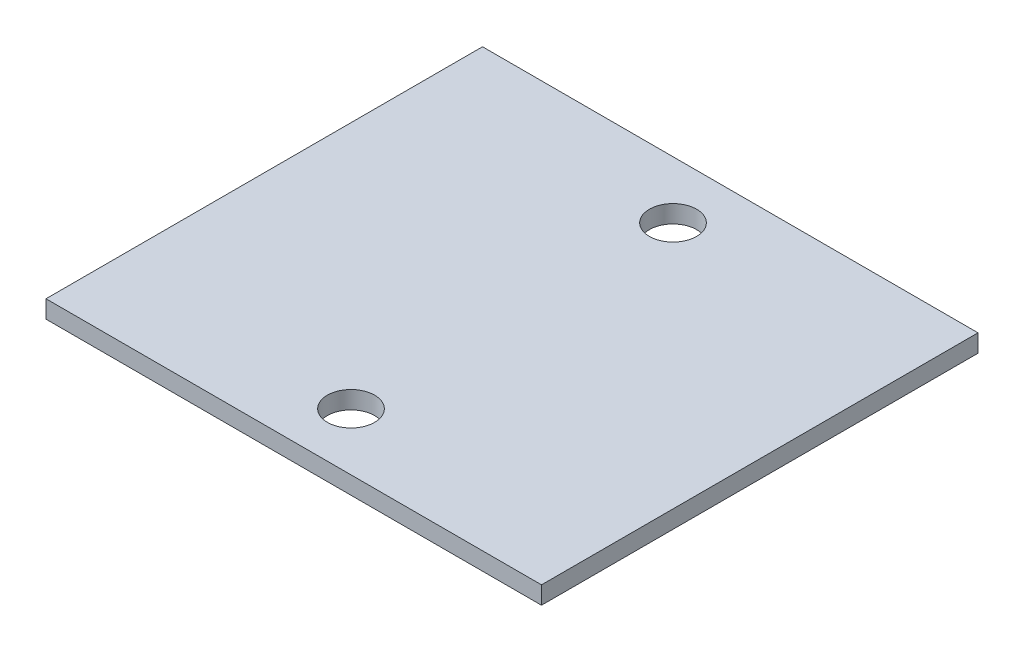
ISO-10303-21;
HEADER;
FILE_DESCRIPTION(('STEP AP214'),'2;1');
FILE_NAME('part.step','',(''),(''),'','','');
FILE_SCHEMA(('AUTOMOTIVE_DESIGN { 1 0 10303 214 1 1 1 1 }'));
ENDSEC;
DATA;
#1=APPLICATION_CONTEXT('core data for automotive mechanical design processes');
#2=APPLICATION_PROTOCOL_DEFINITION('international standard','automotive_design',2000,#1);
#3=PRODUCT_CONTEXT('',#1,'mechanical');
#4=PRODUCT('Part','Part','',(#3));
#5=PRODUCT_RELATED_PRODUCT_CATEGORY('part','',(#4));
#6=PRODUCT_DEFINITION_FORMATION('','',#4);
#7=PRODUCT_DEFINITION_CONTEXT('part definition',#1,'design');
#8=PRODUCT_DEFINITION('design','',#6,#7);
#9=PRODUCT_DEFINITION_SHAPE('','',#8);
#10=(LENGTH_UNIT() NAMED_UNIT(*) SI_UNIT(.MILLI.,.METRE.));
#11=(NAMED_UNIT(*) PLANE_ANGLE_UNIT() SI_UNIT($,.RADIAN.));
#12=(NAMED_UNIT(*) SI_UNIT($,.STERADIAN.) SOLID_ANGLE_UNIT());
#13=UNCERTAINTY_MEASURE_WITH_UNIT(LENGTH_MEASURE(1.E-05),#10,'distance_accuracy_value','');
#14=(GEOMETRIC_REPRESENTATION_CONTEXT(3) GLOBAL_UNCERTAINTY_ASSIGNED_CONTEXT((#13)) GLOBAL_UNIT_ASSIGNED_CONTEXT((#10,
#11,#12)) REPRESENTATION_CONTEXT('',''));
#15=CARTESIAN_POINT('',(0.,0.,0.));
#16=DIRECTION('',(0.,0.,1.));
#17=DIRECTION('',(1.,0.,0.));
#18=AXIS2_PLACEMENT_3D('',#15,#16,#17);
#19=CARTESIAN_POINT('',(0.,1.5,0.));
#20=DIRECTION('',(0.,-1.,0.));
#21=DIRECTION('',(0.,0.,-1.));
#22=AXIS2_PLACEMENT_3D('',#19,#20,#21);
#23=PLANE('',#22);
#24=DIRECTION('',(0.,0.,1.));
#25=VECTOR('',#24,1.);
#26=CARTESIAN_POINT('',(0.,1.5,0.));
#27=LINE('',#26,#25);
#28=CARTESIAN_POINT('',(0.,1.5,-37.));
#29=VERTEX_POINT('',#28);
#30=CARTESIAN_POINT('',(0.,1.5,0.));
#31=VERTEX_POINT('',#30);
#32=EDGE_CURVE('E92',#29,#31,#27,.T.);
#33=ORIENTED_EDGE('',*,*,#32,.T.);
#34=DIRECTION('',(1.,0.,0.));
#35=VECTOR('',#34,1.);
#36=CARTESIAN_POINT('',(0.,1.5,0.));
#37=LINE('',#36,#35);
#38=CARTESIAN_POINT('',(42.,1.5,0.));
#39=VERTEX_POINT('',#38);
#40=EDGE_CURVE('E87',#31,#39,#37,.T.);
#41=ORIENTED_EDGE('',*,*,#40,.T.);
#42=DIRECTION('',(0.,0.,-1.));
#43=VECTOR('',#42,1.);
#44=CARTESIAN_POINT('',(42.,1.5,0.));
#45=LINE('',#44,#43);
#46=CARTESIAN_POINT('',(42.,1.5,-37.));
#47=VERTEX_POINT('',#46);
#48=EDGE_CURVE('E90',#39,#47,#45,.T.);
#49=ORIENTED_EDGE('',*,*,#48,.T.);
#50=DIRECTION('',(-1.,0.,0.));
#51=VECTOR('',#50,1.);
#52=CARTESIAN_POINT('',(0.,1.5,-37.));
#53=LINE('',#52,#51);
#54=EDGE_CURVE('E57',#47,#29,#53,.T.);
#55=ORIENTED_EDGE('',*,*,#54,.T.);
#56=EDGE_LOOP('',(#33,#41,#49,#55));
#57=FACE_BOUND('',#56,.T.);
#58=CARTESIAN_POINT('',(21.,1.5,-32.1488469447029));
#59=DIRECTION('',(0.,1.,0.));
#60=DIRECTION('',(0.,0.,1.));
#61=AXIS2_PLACEMENT_3D('',#58,#59,#60);
#62=CIRCLE('',#61,2.00000000000001);
#63=CARTESIAN_POINT('',(21.,1.5,-30.1488469447029));
#64=VERTEX_POINT('',#63);
#65=EDGE_CURVE('E112',#64,#64,#62,.T.);
#66=ORIENTED_EDGE('',*,*,#65,.F.);
#67=EDGE_LOOP('',(#66));
#68=FACE_BOUND('',#67,.T.);
#69=CARTESIAN_POINT('',(21.,1.5,-4.85115305529707));
#70=DIRECTION('',(0.,1.,0.));
#71=DIRECTION('',(0.,0.,-1.));
#72=AXIS2_PLACEMENT_3D('',#69,#70,#71);
#73=CIRCLE('',#72,2.);
#74=CARTESIAN_POINT('',(21.,1.5,-6.85115305529707));
#75=VERTEX_POINT('',#74);
#76=EDGE_CURVE('E134',#75,#75,#73,.T.);
#77=ORIENTED_EDGE('',*,*,#76,.F.);
#78=EDGE_LOOP('',(#77));
#79=FACE_BOUND('',#78,.T.);
#80=ADVANCED_FACE('F39',(#57,#68,#79),#23,.F.);
#81=CARTESIAN_POINT('',(0.,0.,0.));
#82=DIRECTION('',(0.,-1.,0.));
#83=DIRECTION('',(0.,0.,-1.));
#84=AXIS2_PLACEMENT_3D('',#81,#82,#83);
#85=PLANE('',#84);
#86=CARTESIAN_POINT('',(21.,0.,-32.1488469447029));
#87=DIRECTION('',(0.,1.,0.));
#88=DIRECTION('',(0.,0.,1.));
#89=AXIS2_PLACEMENT_3D('',#86,#87,#88);
#90=CIRCLE('',#89,2.00000000000001);
#91=CARTESIAN_POINT('',(21.,0.,-30.1488469447029));
#92=VERTEX_POINT('',#91);
#93=EDGE_CURVE('E130',#92,#92,#90,.T.);
#94=ORIENTED_EDGE('',*,*,#93,.T.);
#95=EDGE_LOOP('',(#94));
#96=FACE_BOUND('',#95,.T.);
#97=DIRECTION('',(0.,0.,1.));
#98=VECTOR('',#97,1.);
#99=CARTESIAN_POINT('',(0.,0.,0.));
#100=LINE('',#99,#98);
#101=CARTESIAN_POINT('',(0.,0.,-37.));
#102=VERTEX_POINT('',#101);
#103=CARTESIAN_POINT('',(0.,0.,0.));
#104=VERTEX_POINT('',#103);
#105=EDGE_CURVE('E108',#102,#104,#100,.T.);
#106=ORIENTED_EDGE('',*,*,#105,.F.);
#107=DIRECTION('',(-1.,0.,0.));
#108=VECTOR('',#107,1.);
#109=CARTESIAN_POINT('',(0.,0.,-37.));
#110=LINE('',#109,#108);
#111=CARTESIAN_POINT('',(42.,0.,-37.));
#112=VERTEX_POINT('',#111);
#113=EDGE_CURVE('E80',#112,#102,#110,.T.);
#114=ORIENTED_EDGE('',*,*,#113,.F.);
#115=DIRECTION('',(0.,0.,-1.));
#116=VECTOR('',#115,1.);
#117=CARTESIAN_POINT('',(42.,0.,0.));
#118=LINE('',#117,#116);
#119=CARTESIAN_POINT('',(42.,0.,0.));
#120=VERTEX_POINT('',#119);
#121=EDGE_CURVE('E74',#120,#112,#118,.T.);
#122=ORIENTED_EDGE('',*,*,#121,.F.);
#123=DIRECTION('',(1.,0.,0.));
#124=VECTOR('',#123,1.);
#125=CARTESIAN_POINT('',(0.,0.,0.));
#126=LINE('',#125,#124);
#127=EDGE_CURVE('E97',#104,#120,#126,.T.);
#128=ORIENTED_EDGE('',*,*,#127,.F.);
#129=EDGE_LOOP('',(#106,#114,#122,#128));
#130=FACE_BOUND('',#129,.T.);
#131=CARTESIAN_POINT('',(21.,0.,-4.85115305529707));
#132=DIRECTION('',(0.,1.,0.));
#133=DIRECTION('',(0.,0.,-1.));
#134=AXIS2_PLACEMENT_3D('',#131,#132,#133);
#135=CIRCLE('',#134,2.);
#136=CARTESIAN_POINT('',(21.,0.,-6.85115305529707));
#137=VERTEX_POINT('',#136);
#138=EDGE_CURVE('E138',#137,#137,#135,.T.);
#139=ORIENTED_EDGE('',*,*,#138,.T.);
#140=EDGE_LOOP('',(#139));
#141=FACE_BOUND('',#140,.T.);
#142=ADVANCED_FACE('F125',(#96,#130,#141),#85,.T.);
#143=CARTESIAN_POINT('',(0.,1.5,0.));
#144=DIRECTION('',(1.,0.,0.));
#145=DIRECTION('',(0.,0.,-1.));
#146=AXIS2_PLACEMENT_3D('',#143,#144,#145);
#147=PLANE('',#146);
#148=ORIENTED_EDGE('',*,*,#105,.T.);
#149=DIRECTION('',(0.,-1.,0.));
#150=VECTOR('',#149,1.);
#151=CARTESIAN_POINT('',(0.,1.5,0.));
#152=LINE('',#151,#150);
#153=EDGE_CURVE('E11',#31,#104,#152,.T.);
#154=ORIENTED_EDGE('',*,*,#153,.F.);
#155=ORIENTED_EDGE('',*,*,#32,.F.);
#156=DIRECTION('',(0.,-1.,0.));
#157=VECTOR('',#156,1.);
#158=CARTESIAN_POINT('',(0.,1.5,-37.));
#159=LINE('',#158,#157);
#160=EDGE_CURVE('E104',#29,#102,#159,.T.);
#161=ORIENTED_EDGE('',*,*,#160,.T.);
#162=EDGE_LOOP('',(#148,#154,#155,#161));
#163=FACE_BOUND('',#162,.T.);
#164=ADVANCED_FACE('F41',(#163),#147,.F.);
#165=CARTESIAN_POINT('',(0.,1.5,0.));
#166=DIRECTION('',(0.,0.,-1.));
#167=DIRECTION('',(-1.,0.,0.));
#168=AXIS2_PLACEMENT_3D('',#165,#166,#167);
#169=PLANE('',#168);
#170=ORIENTED_EDGE('',*,*,#127,.T.);
#171=DIRECTION('',(0.,-1.,0.));
#172=VECTOR('',#171,1.);
#173=CARTESIAN_POINT('',(42.,1.5,0.));
#174=LINE('',#173,#172);
#175=EDGE_CURVE('E49',#39,#120,#174,.T.);
#176=ORIENTED_EDGE('',*,*,#175,.F.);
#177=ORIENTED_EDGE('',*,*,#40,.F.);
#178=ORIENTED_EDGE('',*,*,#153,.T.);
#179=EDGE_LOOP('',(#170,#176,#177,#178));
#180=FACE_BOUND('',#179,.T.);
#181=ADVANCED_FACE('F96',(#180),#169,.F.);
#182=CARTESIAN_POINT('',(42.,1.5,0.));
#183=DIRECTION('',(-1.,0.,0.));
#184=DIRECTION('',(0.,0.,1.));
#185=AXIS2_PLACEMENT_3D('',#182,#183,#184);
#186=PLANE('',#185);
#187=ORIENTED_EDGE('',*,*,#121,.T.);
#188=DIRECTION('',(0.,-1.,0.));
#189=VECTOR('',#188,1.);
#190=CARTESIAN_POINT('',(42.,1.5,-37.));
#191=LINE('',#190,#189);
#192=EDGE_CURVE('E99',#47,#112,#191,.T.);
#193=ORIENTED_EDGE('',*,*,#192,.F.);
#194=ORIENTED_EDGE('',*,*,#48,.F.);
#195=ORIENTED_EDGE('',*,*,#175,.T.);
#196=EDGE_LOOP('',(#187,#193,#194,#195));
#197=FACE_BOUND('',#196,.T.);
#198=ADVANCED_FACE('F100',(#197),#186,.F.);
#199=CARTESIAN_POINT('',(0.,1.5,-37.));
#200=DIRECTION('',(0.,0.,1.));
#201=DIRECTION('',(1.,0.,0.));
#202=AXIS2_PLACEMENT_3D('',#199,#200,#201);
#203=PLANE('',#202);
#204=ORIENTED_EDGE('',*,*,#113,.T.);
#205=ORIENTED_EDGE('',*,*,#160,.F.);
#206=ORIENTED_EDGE('',*,*,#54,.F.);
#207=ORIENTED_EDGE('',*,*,#192,.T.);
#208=EDGE_LOOP('',(#204,#205,#206,#207));
#209=FACE_BOUND('',#208,.T.);
#210=ADVANCED_FACE('F122',(#209),#203,.F.);
#211=CARTESIAN_POINT('',(21.,1.5,-32.1488469447029));
#212=DIRECTION('',(0.,-1.,0.));
#213=DIRECTION('',(0.,0.,-1.));
#214=AXIS2_PLACEMENT_3D('',#211,#212,#213);
#215=CYLINDRICAL_SURFACE('',#214,2.00000000000001);
#216=ORIENTED_EDGE('',*,*,#65,.T.);
#217=EDGE_LOOP('',(#216));
#218=FACE_BOUND('',#217,.T.);
#219=ORIENTED_EDGE('',*,*,#93,.F.);
#220=EDGE_LOOP('',(#219));
#221=FACE_BOUND('',#220,.T.);
#222=ADVANCED_FACE('F157',(#218,#221),#215,.F.);
#223=CARTESIAN_POINT('',(21.,1.5,-4.85115305529707));
#224=DIRECTION('',(0.,-1.,0.));
#225=DIRECTION('',(0.,0.,-1.));
#226=AXIS2_PLACEMENT_3D('',#223,#224,#225);
#227=CYLINDRICAL_SURFACE('',#226,2.);
#228=ORIENTED_EDGE('',*,*,#76,.T.);
#229=EDGE_LOOP('',(#228));
#230=FACE_BOUND('',#229,.T.);
#231=ORIENTED_EDGE('',*,*,#138,.F.);
#232=EDGE_LOOP('',(#231));
#233=FACE_BOUND('',#232,.T.);
#234=ADVANCED_FACE('F146',(#230,#233),#227,.F.);
#235=CLOSED_SHELL('',(#80,#142,#164,#181,#198,#210,#222,#234));
#236=MANIFOLD_SOLID_BREP('B2',#235);
#237=ADVANCED_BREP_SHAPE_REPRESENTATION('',(#18,#236),#14);
#238=SHAPE_DEFINITION_REPRESENTATION(#9,#237);
ENDSEC;
END-ISO-10303-21;
